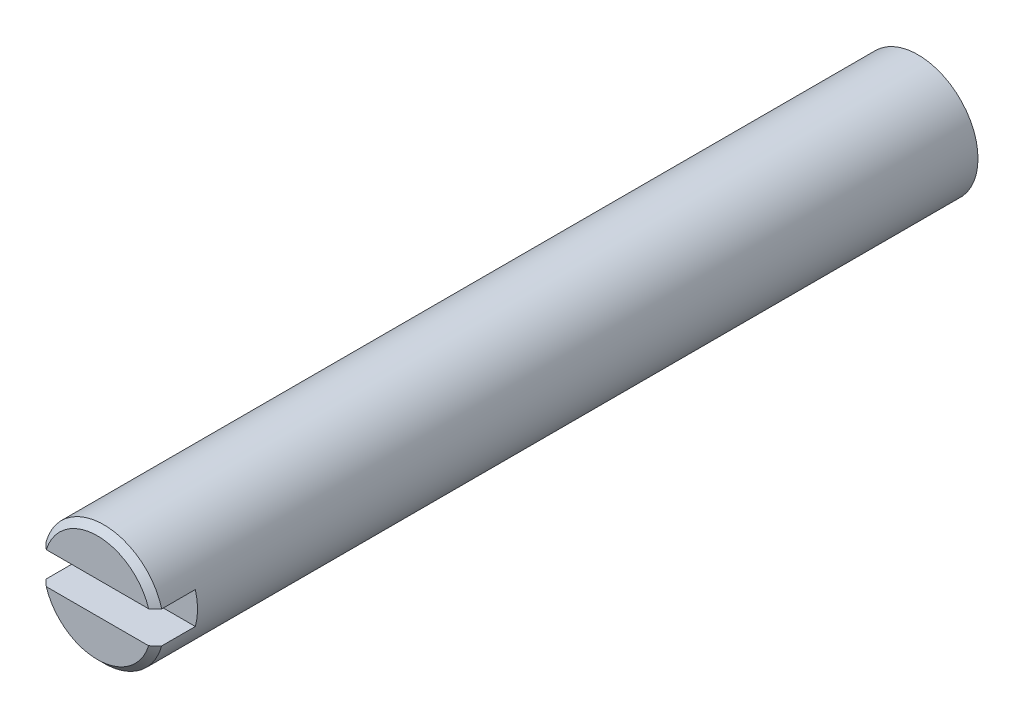
ISO-10303-21;
HEADER;
FILE_DESCRIPTION(('STEP AP214'),'2;1');
FILE_NAME('part.step','',(''),(''),'','','');
FILE_SCHEMA(('AUTOMOTIVE_DESIGN { 1 0 10303 214 1 1 1 1 }'));
ENDSEC;
DATA;
#1=APPLICATION_CONTEXT('core data for automotive mechanical design processes');
#2=APPLICATION_PROTOCOL_DEFINITION('international standard','automotive_design',2000,#1);
#3=PRODUCT_CONTEXT('',#1,'mechanical');
#4=PRODUCT('Part','Part','',(#3));
#5=PRODUCT_RELATED_PRODUCT_CATEGORY('part','',(#4));
#6=PRODUCT_DEFINITION_FORMATION('','',#4);
#7=PRODUCT_DEFINITION_CONTEXT('part definition',#1,'design');
#8=PRODUCT_DEFINITION('design','',#6,#7);
#9=PRODUCT_DEFINITION_SHAPE('','',#8);
#10=(LENGTH_UNIT() NAMED_UNIT(*) SI_UNIT(.MILLI.,.METRE.));
#11=(NAMED_UNIT(*) PLANE_ANGLE_UNIT() SI_UNIT($,.RADIAN.));
#12=(NAMED_UNIT(*) SI_UNIT($,.STERADIAN.) SOLID_ANGLE_UNIT());
#13=UNCERTAINTY_MEASURE_WITH_UNIT(LENGTH_MEASURE(1.E-05),#10,'distance_accuracy_value','');
#14=(GEOMETRIC_REPRESENTATION_CONTEXT(3) GLOBAL_UNCERTAINTY_ASSIGNED_CONTEXT((#13)) GLOBAL_UNIT_ASSIGNED_CONTEXT((#10,
#11,#12)) REPRESENTATION_CONTEXT('',''));
#15=CARTESIAN_POINT('',(0.,0.,0.));
#16=DIRECTION('',(0.,0.,1.));
#17=DIRECTION('',(1.,0.,0.));
#18=AXIS2_PLACEMENT_3D('',#15,#16,#17);
#19=CARTESIAN_POINT('',(0.,0.,65.1002));
#20=DIRECTION('',(0.,0.,1.));
#21=DIRECTION('',(1.,0.,0.));
#22=AXIS2_PLACEMENT_3D('',#19,#20,#21);
#23=PLANE('',#22);
#24=DIRECTION('',(1.,0.,0.));
#25=VECTOR('',#24,1.);
#26=CARTESIAN_POINT('',(0.,-1.27,65.1002));
#27=LINE('',#26,#25);
#28=CARTESIAN_POINT('',(-4.06052585880205,-1.27,65.1002));
#29=VERTEX_POINT('',#28);
#30=CARTESIAN_POINT('',(4.06052585880205,-1.27,65.1002));
#31=VERTEX_POINT('',#30);
#32=EDGE_CURVE('E131',#29,#31,#27,.T.);
#33=ORIENTED_EDGE('',*,*,#32,.F.);
#34=CARTESIAN_POINT('',(0.,0.,65.1002));
#35=DIRECTION('',(0.,0.,1.));
#36=DIRECTION('',(1.,0.,0.));
#37=AXIS2_PLACEMENT_3D('',#34,#35,#36);
#38=CIRCLE('',#37,4.25450000000002);
#39=EDGE_CURVE('E200',#29,#31,#38,.T.);
#40=ORIENTED_EDGE('',*,*,#39,.T.);
#41=EDGE_LOOP('',(#33,#40));
#42=FACE_BOUND('',#41,.T.);
#43=ADVANCED_FACE('F44',(#42),#23,.T.);
#44=CARTESIAN_POINT('',(0.,0.,65.1002));
#45=DIRECTION('',(0.,0.,-1.));
#46=DIRECTION('',(-1.,0.,0.));
#47=AXIS2_PLACEMENT_3D('',#44,#45,#46);
#48=CYLINDRICAL_SURFACE('',#47,4.7625);
#49=DIRECTION('',(0.,0.,-1.));
#50=VECTOR('',#49,1.);
#51=CARTESIAN_POINT('',(-4.5900442535993,1.27,65.1002));
#52=LINE('',#51,#50);
#53=CARTESIAN_POINT('',(-4.5900442535993,1.27,61.9252));
#54=VERTEX_POINT('',#53);
#55=CARTESIAN_POINT('',(-4.5900442535993,1.27,64.5922));
#56=VERTEX_POINT('',#55);
#57=EDGE_CURVE('E119',#54,#56,#52,.F.);
#58=ORIENTED_EDGE('',*,*,#57,.T.);
#59=CARTESIAN_POINT('',(0.,0.,64.5922));
#60=DIRECTION('',(0.,0.,1.));
#61=DIRECTION('',(1.,0.,0.));
#62=AXIS2_PLACEMENT_3D('',#59,#60,#61);
#63=CIRCLE('',#62,4.7625);
#64=CARTESIAN_POINT('',(4.5900442535993,1.27,64.5922));
#65=VERTEX_POINT('',#64);
#66=EDGE_CURVE('E113',#56,#65,#63,.F.);
#67=ORIENTED_EDGE('',*,*,#66,.T.);
#68=DIRECTION('',(0.,0.,-1.));
#69=VECTOR('',#68,1.);
#70=CARTESIAN_POINT('',(4.5900442535993,1.27,65.1002));
#71=LINE('',#70,#69);
#72=CARTESIAN_POINT('',(4.5900442535993,1.27,61.9252));
#73=VERTEX_POINT('',#72);
#74=EDGE_CURVE('E105',#65,#73,#71,.T.);
#75=ORIENTED_EDGE('',*,*,#74,.T.);
#76=CARTESIAN_POINT('',(0.,0.,61.9252));
#77=DIRECTION('',(0.,0.,1.));
#78=DIRECTION('',(1.,0.,0.));
#79=AXIS2_PLACEMENT_3D('',#76,#77,#78);
#80=CIRCLE('',#79,4.7625);
#81=CARTESIAN_POINT('',(4.5900442535993,-1.27,61.9252));
#82=VERTEX_POINT('',#81);
#83=EDGE_CURVE('E111',#82,#73,#80,.T.);
#84=ORIENTED_EDGE('',*,*,#83,.F.);
#85=DIRECTION('',(0.,0.,-1.));
#86=VECTOR('',#85,1.);
#87=CARTESIAN_POINT('',(4.5900442535993,-1.27,65.1002));
#88=LINE('',#87,#86);
#89=CARTESIAN_POINT('',(4.5900442535993,-1.27,64.5922));
#90=VERTEX_POINT('',#89);
#91=EDGE_CURVE('E118',#82,#90,#88,.F.);
#92=ORIENTED_EDGE('',*,*,#91,.T.);
#93=CARTESIAN_POINT('',(0.,0.,64.5922));
#94=DIRECTION('',(0.,0.,1.));
#95=DIRECTION('',(1.,0.,0.));
#96=AXIS2_PLACEMENT_3D('',#93,#94,#95);
#97=CIRCLE('',#96,4.7625);
#98=CARTESIAN_POINT('',(-4.5900442535993,-1.27,64.5922));
#99=VERTEX_POINT('',#98);
#100=EDGE_CURVE('E205',#90,#99,#97,.F.);
#101=ORIENTED_EDGE('',*,*,#100,.T.);
#102=DIRECTION('',(0.,0.,-1.));
#103=VECTOR('',#102,1.);
#104=CARTESIAN_POINT('',(-4.5900442535993,-1.27,65.1002));
#105=LINE('',#104,#103);
#106=CARTESIAN_POINT('',(-4.5900442535993,-1.27,61.9252));
#107=VERTEX_POINT('',#106);
#108=EDGE_CURVE('E145',#99,#107,#105,.T.);
#109=ORIENTED_EDGE('',*,*,#108,.T.);
#110=EDGE_CURVE('E130',#54,#107,#80,.T.);
#111=ORIENTED_EDGE('',*,*,#110,.F.);
#112=EDGE_LOOP('',(#58,#67,#75,#84,#92,#101,#109,#111));
#113=FACE_BOUND('',#112,.T.);
#114=CARTESIAN_POINT('',(0.,0.,0.));
#115=DIRECTION('',(0.,0.,1.));
#116=DIRECTION('',(1.,0.,0.));
#117=AXIS2_PLACEMENT_3D('',#114,#115,#116);
#118=CIRCLE('',#117,4.7625);
#119=CARTESIAN_POINT('',(4.7625,0.,0.));
#120=VERTEX_POINT('',#119);
#121=EDGE_CURVE('E148',#120,#120,#118,.T.);
#122=ORIENTED_EDGE('',*,*,#121,.T.);
#123=EDGE_LOOP('',(#122));
#124=FACE_BOUND('',#123,.T.);
#125=ADVANCED_FACE('F108',(#113,#124),#48,.T.);
#126=DIRECTION('',(-1.,0.,0.));
#127=VECTOR('',#126,1.);
#128=CARTESIAN_POINT('',(0.,1.27,65.1002));
#129=LINE('',#128,#127);
#130=CARTESIAN_POINT('',(4.06052585880205,1.27,65.1002));
#131=VERTEX_POINT('',#130);
#132=CARTESIAN_POINT('',(-4.06052585880205,1.27,65.1002));
#133=VERTEX_POINT('',#132);
#134=EDGE_CURVE('E152',#131,#133,#129,.T.);
#135=ORIENTED_EDGE('',*,*,#134,.F.);
#136=CARTESIAN_POINT('',(0.,0.,65.1002));
#137=DIRECTION('',(0.,0.,1.));
#138=DIRECTION('',(1.,0.,0.));
#139=AXIS2_PLACEMENT_3D('',#136,#137,#138);
#140=CIRCLE('',#139,4.25450000000002);
#141=EDGE_CURVE('E157',#131,#133,#140,.T.);
#142=ORIENTED_EDGE('',*,*,#141,.T.);
#143=EDGE_LOOP('',(#135,#142));
#144=FACE_BOUND('',#143,.T.);
#145=ADVANCED_FACE('F185',(#144),#23,.T.);
#146=CARTESIAN_POINT('',(0.,0.,0.));
#147=DIRECTION('',(0.,0.,1.));
#148=DIRECTION('',(1.,0.,0.));
#149=AXIS2_PLACEMENT_3D('',#146,#147,#148);
#150=PLANE('',#149);
#151=ORIENTED_EDGE('',*,*,#121,.F.);
#152=EDGE_LOOP('',(#151));
#153=FACE_BOUND('',#152,.T.);
#154=ADVANCED_FACE('F189',(#153),#150,.F.);
#155=CARTESIAN_POINT('',(0.,0.,61.9252));
#156=DIRECTION('',(0.,0.,1.));
#157=DIRECTION('',(1.,0.,0.));
#158=AXIS2_PLACEMENT_3D('',#155,#156,#157);
#159=PLANE('',#158);
#160=DIRECTION('',(-1.,0.,0.));
#161=VECTOR('',#160,1.);
#162=CARTESIAN_POINT('',(-4.7625,1.27,61.9252));
#163=LINE('',#162,#161);
#164=EDGE_CURVE('E126',#73,#54,#163,.T.);
#165=ORIENTED_EDGE('',*,*,#164,.T.);
#166=ORIENTED_EDGE('',*,*,#110,.T.);
#167=DIRECTION('',(1.,0.,0.));
#168=VECTOR('',#167,1.);
#169=CARTESIAN_POINT('',(-4.7625,-1.27,61.9252));
#170=LINE('',#169,#168);
#171=EDGE_CURVE('E128',#107,#82,#170,.T.);
#172=ORIENTED_EDGE('',*,*,#171,.T.);
#173=ORIENTED_EDGE('',*,*,#83,.T.);
#174=EDGE_LOOP('',(#165,#166,#172,#173));
#175=FACE_BOUND('',#174,.T.);
#176=ADVANCED_FACE('F124',(#175),#159,.T.);
#177=CARTESIAN_POINT('',(-4.7625,-1.27,61.9252));
#178=DIRECTION('',(0.,-1.,0.));
#179=DIRECTION('',(0.,0.,-1.));
#180=AXIS2_PLACEMENT_3D('',#177,#178,#179);
#181=PLANE('',#180);
#182=ORIENTED_EDGE('',*,*,#32,.T.);
#183=CARTESIAN_POINT('',(4.06052585880205,-1.27,65.1002));
#184=CARTESIAN_POINT('',(4.14898508513309,-1.27,65.0157482118747));
#185=CARTESIAN_POINT('',(4.23734123487492,-1.27,64.9311889809343));
#186=CARTESIAN_POINT('',(4.41384736643957,-1.27,64.7618556475651));
#187=CARTESIAN_POINT('',(4.50199734829682,-1.27,64.6770815451722));
#188=CARTESIAN_POINT('',(4.5900442535993,-1.27,64.5922));
#189=B_SPLINE_CURVE_WITH_KNOTS('',3,(#183,#184,#185,#186,#187,#188),.UNSPECIFIED.,.F.,.F.,(4,2,
4),(0.,0.366897335244926,0.733794609208243),.UNSPECIFIED.);
#190=EDGE_CURVE('E11',#31,#90,#189,.T.);
#191=ORIENTED_EDGE('',*,*,#190,.T.);
#192=ORIENTED_EDGE('',*,*,#91,.F.);
#193=ORIENTED_EDGE('',*,*,#171,.F.);
#194=ORIENTED_EDGE('',*,*,#108,.F.);
#195=CARTESIAN_POINT('',(-4.5900442535993,-1.27,64.5922));
#196=CARTESIAN_POINT('',(-4.50199734829682,-1.27,64.6770815451722));
#197=CARTESIAN_POINT('',(-4.41384736643957,-1.27,64.7618556475651));
#198=CARTESIAN_POINT('',(-4.23734123487492,-1.27,64.9311889809343));
#199=CARTESIAN_POINT('',(-4.14898508513309,-1.27,65.0157482118747));
#200=CARTESIAN_POINT('',(-4.06052585880205,-1.27,65.1002));
#201=B_SPLINE_CURVE_WITH_KNOTS('',3,(#195,#196,#197,#198,#199,#200),.UNSPECIFIED.,.F.,.F.,(4,2,
4),(0.,0.366897273963317,0.733794609208243),.UNSPECIFIED.);
#202=EDGE_CURVE('E60',#99,#29,#201,.T.);
#203=ORIENTED_EDGE('',*,*,#202,.T.);
#204=EDGE_LOOP('',(#182,#191,#192,#193,#194,#203));
#205=FACE_BOUND('',#204,.T.);
#206=ADVANCED_FACE('F182',(#205),#181,.F.);
#207=CARTESIAN_POINT('',(-4.7625,1.27,61.9252));
#208=DIRECTION('',(0.,1.,0.));
#209=DIRECTION('',(0.,0.,1.));
#210=AXIS2_PLACEMENT_3D('',#207,#208,#209);
#211=PLANE('',#210);
#212=ORIENTED_EDGE('',*,*,#134,.T.);
#213=CARTESIAN_POINT('',(-4.06052585880205,1.27,65.1002));
#214=CARTESIAN_POINT('',(-4.14898508513309,1.27,65.0157482118747));
#215=CARTESIAN_POINT('',(-4.23734123487492,1.27,64.9311889809343));
#216=CARTESIAN_POINT('',(-4.41384736643957,1.27,64.7618556475651));
#217=CARTESIAN_POINT('',(-4.50199734829682,1.27,64.6770815451722));
#218=CARTESIAN_POINT('',(-4.5900442535993,1.27,64.5922));
#219=B_SPLINE_CURVE_WITH_KNOTS('',3,(#213,#214,#215,#216,#217,#218),.UNSPECIFIED.,.F.,.F.,(4,2,
4),(0.,0.366897335244926,0.733794609208243),.UNSPECIFIED.);
#220=EDGE_CURVE('E169',#133,#56,#219,.T.);
#221=ORIENTED_EDGE('',*,*,#220,.T.);
#222=ORIENTED_EDGE('',*,*,#57,.F.);
#223=ORIENTED_EDGE('',*,*,#164,.F.);
#224=ORIENTED_EDGE('',*,*,#74,.F.);
#225=CARTESIAN_POINT('',(4.5900442535993,1.27,64.5922));
#226=CARTESIAN_POINT('',(4.50199734829682,1.27,64.6770815451722));
#227=CARTESIAN_POINT('',(4.41384736643957,1.27,64.7618556475651));
#228=CARTESIAN_POINT('',(4.23734123487492,1.27,64.9311889809343));
#229=CARTESIAN_POINT('',(4.14898508513309,1.27,65.0157482118747));
#230=CARTESIAN_POINT('',(4.06052585880205,1.27,65.1002));
#231=B_SPLINE_CURVE_WITH_KNOTS('',3,(#225,#226,#227,#228,#229,#230),.UNSPECIFIED.,.F.,.F.,(4,2,
4),(0.,0.366897273963318,0.733794609208243),.UNSPECIFIED.);
#232=EDGE_CURVE('E161',#65,#131,#231,.T.);
#233=ORIENTED_EDGE('',*,*,#232,.T.);
#234=EDGE_LOOP('',(#212,#221,#222,#223,#224,#233));
#235=FACE_BOUND('',#234,.T.);
#236=ADVANCED_FACE('F135',(#235),#211,.F.);
#237=CARTESIAN_POINT('',(0.,0.,65.1002));
#238=DIRECTION('',(0.,0.,-1.));
#239=DIRECTION('',(-1.,0.,0.));
#240=AXIS2_PLACEMENT_3D('',#237,#238,#239);
#241=CONICAL_SURFACE('',#240,4.25450000000002,0.785398163397453);
#242=ORIENTED_EDGE('',*,*,#232,.F.);
#243=ORIENTED_EDGE('',*,*,#66,.F.);
#244=ORIENTED_EDGE('',*,*,#220,.F.);
#245=ORIENTED_EDGE('',*,*,#141,.F.);
#246=EDGE_LOOP('',(#242,#243,#244,#245));
#247=FACE_BOUND('',#246,.T.);
#248=ADVANCED_FACE('F176',(#247),#241,.T.);
#249=CARTESIAN_POINT('',(0.,0.,65.1002));
#250=DIRECTION('',(0.,0.,-1.));
#251=DIRECTION('',(-1.,0.,0.));
#252=AXIS2_PLACEMENT_3D('',#249,#250,#251);
#253=CONICAL_SURFACE('',#252,4.25450000000002,0.785398163397453);
#254=ORIENTED_EDGE('',*,*,#202,.F.);
#255=ORIENTED_EDGE('',*,*,#100,.F.);
#256=ORIENTED_EDGE('',*,*,#190,.F.);
#257=ORIENTED_EDGE('',*,*,#39,.F.);
#258=EDGE_LOOP('',(#254,#255,#256,#257));
#259=FACE_BOUND('',#258,.T.);
#260=ADVANCED_FACE('F47',(#259),#253,.T.);
#261=CLOSED_SHELL('',(#43,#125,#145,#154,#176,#206,#236,#248,#260));
#262=MANIFOLD_SOLID_BREP('B2',#261);
#263=ADVANCED_BREP_SHAPE_REPRESENTATION('',(#18,#262),#14);
#264=SHAPE_DEFINITION_REPRESENTATION(#9,#263);
ENDSEC;
END-ISO-10303-21;
